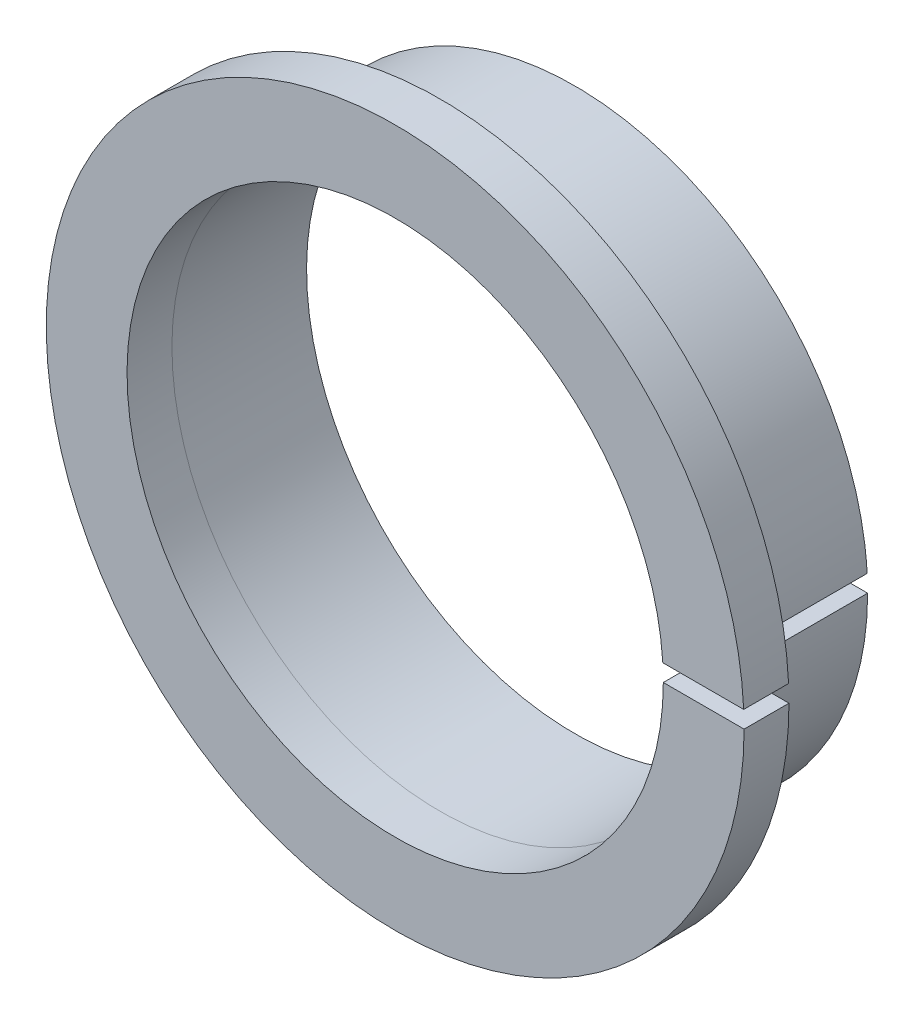
ISO-10303-21;
HEADER;
FILE_DESCRIPTION(('STEP AP214'),'2;1');
FILE_NAME('part.step','',(''),(''),'','','');
FILE_SCHEMA(('AUTOMOTIVE_DESIGN { 1 0 10303 214 1 1 1 1 }'));
ENDSEC;
DATA;
#1=APPLICATION_CONTEXT('core data for automotive mechanical design processes');
#2=APPLICATION_PROTOCOL_DEFINITION('international standard','automotive_design',2000,#1);
#3=PRODUCT_CONTEXT('',#1,'mechanical');
#4=PRODUCT('Part','Part','',(#3));
#5=PRODUCT_RELATED_PRODUCT_CATEGORY('part','',(#4));
#6=PRODUCT_DEFINITION_FORMATION('','',#4);
#7=PRODUCT_DEFINITION_CONTEXT('part definition',#1,'design');
#8=PRODUCT_DEFINITION('design','',#6,#7);
#9=PRODUCT_DEFINITION_SHAPE('','',#8);
#10=(LENGTH_UNIT() NAMED_UNIT(*) SI_UNIT(.MILLI.,.METRE.));
#11=(NAMED_UNIT(*) PLANE_ANGLE_UNIT() SI_UNIT($,.RADIAN.));
#12=(NAMED_UNIT(*) SI_UNIT($,.STERADIAN.) SOLID_ANGLE_UNIT());
#13=UNCERTAINTY_MEASURE_WITH_UNIT(LENGTH_MEASURE(1.E-05),#10,'distance_accuracy_value','');
#14=(GEOMETRIC_REPRESENTATION_CONTEXT(3) GLOBAL_UNCERTAINTY_ASSIGNED_CONTEXT((#13)) GLOBAL_UNIT_ASSIGNED_CONTEXT((#10,
#11,#12)) REPRESENTATION_CONTEXT('',''));
#15=CARTESIAN_POINT('',(0.,0.,0.));
#16=DIRECTION('',(0.,0.,1.));
#17=DIRECTION('',(1.,0.,0.));
#18=AXIS2_PLACEMENT_3D('',#15,#16,#17);
#19=CARTESIAN_POINT('',(2.00705354308598E-06,1.42271752411411E-07,-2.));
#20=DIRECTION('',(0.,0.,1.));
#21=DIRECTION('',(1.,0.,0.));
#22=AXIS2_PLACEMENT_3D('',#19,#20,#21);
#23=CYLINDRICAL_SURFACE('',#22,11.9493911238797);
#24=CARTESIAN_POINT('',(2.00705354308598E-06,1.42271752411411E-07,0.));
#25=DIRECTION('',(0.,0.,-1.));
#26=DIRECTION('',(1.,0.,0.));
#27=AXIS2_PLACEMENT_3D('',#24,#25,#26);
#28=CIRCLE('',#27,11.9493911238797);
#29=CARTESIAN_POINT('',(11.9493931309332,7.16342408847453E-12,0.));
#30=VERTEX_POINT('',#29);
#31=CARTESIAN_POINT('',(11.9258310493475,0.750033398489146,0.));
#32=VERTEX_POINT('',#31);
#33=EDGE_CURVE('E135',#30,#32,#28,.T.);
#34=ORIENTED_EDGE('',*,*,#33,.F.);
#35=DIRECTION('',(0.,0.,1.));
#36=VECTOR('',#35,1.);
#37=CARTESIAN_POINT('',(11.9493931309332,7.16342408847453E-12,-2.));
#38=LINE('',#37,#36);
#39=CARTESIAN_POINT('',(11.9493931309332,7.16342408847453E-12,-2.));
#40=VERTEX_POINT('',#39);
#41=EDGE_CURVE('E11',#40,#30,#38,.T.);
#42=ORIENTED_EDGE('',*,*,#41,.F.);
#43=CARTESIAN_POINT('',(2.00705354308598E-06,1.42271752411411E-07,-2.));
#44=DIRECTION('',(0.,0.,-1.));
#45=DIRECTION('',(1.,-1.19055932008702E-08,0.));
#46=AXIS2_PLACEMENT_3D('',#43,#44,#45);
#47=CIRCLE('',#46,11.9493911238797);
#48=CARTESIAN_POINT('',(11.9258310493475,0.750033398489146,-2.));
#49=VERTEX_POINT('',#48);
#50=EDGE_CURVE('E161',#40,#49,#47,.T.);
#51=ORIENTED_EDGE('',*,*,#50,.T.);
#52=DIRECTION('',(0.,0.,1.));
#53=VECTOR('',#52,1.);
#54=CARTESIAN_POINT('',(11.9258310493475,0.750033398489146,-2.));
#55=LINE('',#54,#53);
#56=EDGE_CURVE('E95',#49,#32,#55,.T.);
#57=ORIENTED_EDGE('',*,*,#56,.T.);
#58=EDGE_LOOP('',(#34,#42,#51,#57));
#59=FACE_BOUND('',#58,.T.);
#60=ADVANCED_FACE('F45',(#59),#23,.F.);
#61=CARTESIAN_POINT('',(15.549186155929,7.16342408844868E-12,-2.));
#62=DIRECTION('',(0.,1.,0.));
#63=DIRECTION('',(-1.,0.,0.));
#64=AXIS2_PLACEMENT_3D('',#61,#62,#63);
#65=PLANE('',#64);
#66=DIRECTION('',(-1.,0.,0.));
#67=VECTOR('',#66,1.);
#68=CARTESIAN_POINT('',(15.549186155929,7.16342408844868E-12,0.));
#69=LINE('',#68,#67);
#70=CARTESIAN_POINT('',(15.549186155929,7.16949710395623E-12,0.));
#71=VERTEX_POINT('',#70);
#72=EDGE_CURVE('E158',#71,#30,#69,.T.);
#73=ORIENTED_EDGE('',*,*,#72,.F.);
#74=DIRECTION('',(0.,0.,1.));
#75=VECTOR('',#74,1.);
#76=CARTESIAN_POINT('',(15.549186155929,7.16949710395623E-12,-2.));
#77=LINE('',#76,#75);
#78=CARTESIAN_POINT('',(15.549186155929,7.16949710395623E-12,-2.));
#79=VERTEX_POINT('',#78);
#80=EDGE_CURVE('E55',#79,#71,#77,.T.);
#81=ORIENTED_EDGE('',*,*,#80,.F.);
#82=DIRECTION('',(-1.,0.,0.));
#83=VECTOR('',#82,1.);
#84=CARTESIAN_POINT('',(15.549186155929,7.16342408844868E-12,-2.));
#85=LINE('',#84,#83);
#86=CARTESIAN_POINT('',(13.0543309151246,7.1634240884666E-12,-2.));
#87=VERTEX_POINT('',#86);
#88=EDGE_CURVE('E175',#79,#87,#85,.T.);
#89=ORIENTED_EDGE('',*,*,#88,.T.);
#90=DIRECTION('',(0.,0.,1.));
#91=VECTOR('',#90,1.);
#92=CARTESIAN_POINT('',(13.0543309151246,-1.0975886217303E-11,-8.));
#93=LINE('',#92,#91);
#94=CARTESIAN_POINT('',(13.0543309151246,-1.0975886217303E-11,-8.));
#95=VERTEX_POINT('',#94);
#96=EDGE_CURVE('E222',#95,#87,#93,.T.);
#97=ORIENTED_EDGE('',*,*,#96,.F.);
#98=DIRECTION('',(1.,0.,0.));
#99=VECTOR('',#98,1.);
#100=CARTESIAN_POINT('',(13.0543309151246,-1.0975886217303E-11,-8.));
#101=LINE('',#100,#99);
#102=CARTESIAN_POINT('',(11.9493931368572,-1.0975886217303E-11,-8.));
#103=VERTEX_POINT('',#102);
#104=EDGE_CURVE('E129',#103,#95,#101,.T.);
#105=ORIENTED_EDGE('',*,*,#104,.F.);
#106=DIRECTION('',(0.,0.,1.));
#107=VECTOR('',#106,1.);
#108=CARTESIAN_POINT('',(11.9493931368572,-1.0975886217303E-11,-8.));
#109=LINE('',#108,#107);
#110=EDGE_CURVE('E140',#103,#40,#109,.T.);
#111=ORIENTED_EDGE('',*,*,#110,.T.);
#112=ORIENTED_EDGE('',*,*,#41,.T.);
#113=EDGE_LOOP('',(#73,#81,#89,#97,#105,#111,#112));
#114=FACE_BOUND('',#113,.T.);
#115=ADVANCED_FACE('F205',(#114),#65,.T.);
#116=CARTESIAN_POINT('',(-9.8254210221895E-06,-3.26972824382649E-07,-2.));
#117=DIRECTION('',(0.,0.,1.));
#118=DIRECTION('',(1.,0.,0.));
#119=AXIS2_PLACEMENT_3D('',#116,#117,#118);
#120=CYLINDRICAL_SURFACE('',#119,15.5491959813501);
#121=CARTESIAN_POINT('',(-9.8254210221895E-06,-3.26972824382649E-07,0.));
#122=DIRECTION('',(0.,0.,1.));
#123=DIRECTION('',(1.,0.,0.));
#124=AXIS2_PLACEMENT_3D('',#121,#122,#123);
#125=CIRCLE('',#124,15.5491959813501);
#126=CARTESIAN_POINT('',(15.5310846262461,0.750066869901386,0.));
#127=VERTEX_POINT('',#126);
#128=EDGE_CURVE('E155',#127,#71,#125,.T.);
#129=ORIENTED_EDGE('',*,*,#128,.F.);
#130=DIRECTION('',(0.,0.,1.));
#131=VECTOR('',#130,1.);
#132=CARTESIAN_POINT('',(15.5310846262461,0.750066869901386,-2.));
#133=LINE('',#132,#131);
#134=CARTESIAN_POINT('',(15.5310846262461,0.750066869901386,-2.));
#135=VERTEX_POINT('',#134);
#136=EDGE_CURVE('E163',#135,#127,#133,.T.);
#137=ORIENTED_EDGE('',*,*,#136,.F.);
#138=CARTESIAN_POINT('',(-9.8254210221895E-06,-3.26972824382649E-07,-2.));
#139=DIRECTION('',(0.,0.,1.));
#140=DIRECTION('',(1.,0.,0.));
#141=AXIS2_PLACEMENT_3D('',#138,#139,#140);
#142=CIRCLE('',#141,15.5491959813501);
#143=EDGE_CURVE('E177',#135,#79,#142,.T.);
#144=ORIENTED_EDGE('',*,*,#143,.T.);
#145=ORIENTED_EDGE('',*,*,#80,.T.);
#146=EDGE_LOOP('',(#129,#137,#144,#145));
#147=FACE_BOUND('',#146,.T.);
#148=ADVANCED_FACE('F202',(#147),#120,.T.);
#149=CARTESIAN_POINT('',(11.9258310493475,0.750033398489146,-2.));
#150=DIRECTION('',(9.28406602328647E-06,-0.999999999956903,0.));
#151=DIRECTION('',(0.999999999956903,9.28406602328647E-06,0.));
#152=AXIS2_PLACEMENT_3D('',#149,#150,#151);
#153=PLANE('',#152);
#154=DIRECTION('',(0.999999999956903,9.28406602328647E-06,0.));
#155=VECTOR('',#154,1.);
#156=CARTESIAN_POINT('',(11.9258310493475,0.750033398489146,0.));
#157=LINE('',#156,#155);
#158=EDGE_CURVE('E138',#32,#127,#157,.T.);
#159=ORIENTED_EDGE('',*,*,#158,.F.);
#160=ORIENTED_EDGE('',*,*,#56,.F.);
#161=CARTESIAN_POINT('',(11.9258310493475,0.750033398489146,-2.));
#162=DIRECTION('',(0.999999999956903,9.2840660232462E-06,0.));
#163=VECTOR('',#162,1.);
#164=LINE('',#161,#163);
#165=CARTESIAN_POINT('',(13.0327653459519,0.750055352562733,-2.));
#166=VERTEX_POINT('',#165);
#167=EDGE_CURVE('E184',#49,#166,#164,.T.);
#168=ORIENTED_EDGE('',*,*,#167,.T.);
#169=CARTESIAN_POINT('',(13.0327660179932,0.750043675346479,-2.));
#170=DIRECTION('',(0.999999999956903,9.28406602330431E-06,0.));
#171=VECTOR('',#170,1.);
#172=LINE('',#169,#171);
#173=EDGE_CURVE('E250',#166,#135,#172,.T.);
#174=ORIENTED_EDGE('',*,*,#173,.T.);
#175=ORIENTED_EDGE('',*,*,#136,.T.);
#176=EDGE_LOOP('',(#159,#160,#168,#174,#175));
#177=FACE_BOUND('',#176,.T.);
#178=ADVANCED_FACE('F192',(#177),#153,.T.);
#179=CARTESIAN_POINT('',(2.00705354308598E-06,1.42271752411411E-07,-2.));
#180=DIRECTION('',(0.,0.,1.));
#181=DIRECTION('',(1.,0.,0.));
#182=AXIS2_PLACEMENT_3D('',#179,#180,#181);
#183=PLANE('',#182);
#184=CARTESIAN_POINT('',(-6.04501046479502E-06,-2.05061976929599E-07,-2.));
#185=DIRECTION('',(0.,0.,-1.));
#186=DIRECTION('',(0.,1.,0.));
#187=AXIS2_PLACEMENT_3D('',#184,#185,#186);
#188=ELLIPSE('',#187,13.0543369601399,13.054336960135);
#189=EDGE_CURVE('E62',#87,#166,#188,.T.);
#190=ORIENTED_EDGE('',*,*,#189,.F.);
#191=ORIENTED_EDGE('',*,*,#88,.F.);
#192=ORIENTED_EDGE('',*,*,#143,.F.);
#193=ORIENTED_EDGE('',*,*,#173,.F.);
#194=EDGE_LOOP('',(#190,#191,#192,#193));
#195=FACE_BOUND('',#194,.T.);
#196=ADVANCED_FACE('F201',(#195),#183,.F.);
#197=CARTESIAN_POINT('',(2.00705354308598E-06,1.42271752411411E-07,0.));
#198=DIRECTION('',(0.,0.,1.));
#199=DIRECTION('',(1.,0.,0.));
#200=AXIS2_PLACEMENT_3D('',#197,#198,#199);
#201=PLANE('',#200);
#202=ORIENTED_EDGE('',*,*,#33,.T.);
#203=ORIENTED_EDGE('',*,*,#158,.T.);
#204=ORIENTED_EDGE('',*,*,#128,.T.);
#205=ORIENTED_EDGE('',*,*,#72,.T.);
#206=EDGE_LOOP('',(#202,#203,#204,#205));
#207=FACE_BOUND('',#206,.T.);
#208=ADVANCED_FACE('F209',(#207),#201,.T.);
#209=CARTESIAN_POINT('',(-6.04501046479502E-06,-2.05061976929599E-07,-8.));
#210=DIRECTION('',(0.,0.,-1.));
#211=DIRECTION('',(0.,1.,0.));
#212=AXIS2_PLACEMENT_3D('',#209,#210,#211);
#213=ELLIPSE('',#212,13.0543369601399,13.054336960135);
#214=DIRECTION('',(0.,0.,1.));
#215=VECTOR('',#214,1.);
#216=SURFACE_OF_LINEAR_EXTRUSION('',#213,#215);
#217=ORIENTED_EDGE('',*,*,#189,.T.);
#218=DIRECTION('',(0.,0.,1.));
#219=VECTOR('',#218,1.);
#220=CARTESIAN_POINT('',(13.0327646739106,0.750067029778987,-8.));
#221=LINE('',#220,#219);
#222=CARTESIAN_POINT('',(13.0327646739106,0.750067029778987,-8.));
#223=VERTEX_POINT('',#222);
#224=EDGE_CURVE('E118',#223,#166,#221,.T.);
#225=ORIENTED_EDGE('',*,*,#224,.F.);
#226=EDGE_CURVE('E124',#95,#223,#213,.T.);
#227=ORIENTED_EDGE('',*,*,#226,.F.);
#228=ORIENTED_EDGE('',*,*,#96,.T.);
#229=EDGE_LOOP('',(#217,#225,#227,#228));
#230=FACE_BOUND('',#229,.T.);
#231=ADVANCED_FACE('F134',(#230),#216,.F.);
#232=CARTESIAN_POINT('',(13.0327646739106,0.750067029778987,-8.));
#233=DIRECTION('',(-3.03823906683306E-05,0.999999999538455,0.));
#234=DIRECTION('',(-0.999999999538455,-3.03823906683306E-05,0.));
#235=AXIS2_PLACEMENT_3D('',#232,#233,#234);
#236=PLANE('',#235);
#237=ORIENTED_EDGE('',*,*,#167,.F.);
#238=DIRECTION('',(0.,0.,1.));
#239=VECTOR('',#238,1.);
#240=CARTESIAN_POINT('',(11.9258310493475,0.750033398489157,-8.));
#241=LINE('',#240,#239);
#242=CARTESIAN_POINT('',(11.9258310493475,0.750033398489157,-8.));
#243=VERTEX_POINT('',#242);
#244=EDGE_CURVE('E120',#243,#49,#241,.T.);
#245=ORIENTED_EDGE('',*,*,#244,.F.);
#246=DIRECTION('',(-0.999999999538455,-3.03823906683306E-05,0.));
#247=VECTOR('',#246,1.);
#248=CARTESIAN_POINT('',(13.0327646739106,0.750067029778987,-8.));
#249=LINE('',#248,#247);
#250=EDGE_CURVE('E113',#223,#243,#249,.T.);
#251=ORIENTED_EDGE('',*,*,#250,.F.);
#252=ORIENTED_EDGE('',*,*,#224,.T.);
#253=EDGE_LOOP('',(#237,#245,#251,#252));
#254=FACE_BOUND('',#253,.T.);
#255=ADVANCED_FACE('F116',(#254),#236,.F.);
#256=CARTESIAN_POINT('',(-6.04501046479502E-06,-2.05061976929599E-07,-8.));
#257=DIRECTION('',(0.,0.,1.));
#258=DIRECTION('',(1.,0.,0.));
#259=AXIS2_PLACEMENT_3D('',#256,#257,#258);
#260=CYLINDRICAL_SURFACE('',#259,11.9493991818677);
#261=ORIENTED_EDGE('',*,*,#50,.F.);
#262=ORIENTED_EDGE('',*,*,#110,.F.);
#263=CARTESIAN_POINT('',(-6.04501046479502E-06,-2.05061976929599E-07,-8.));
#264=DIRECTION('',(0.,0.,1.));
#265=DIRECTION('',(-1.,0.,0.));
#266=AXIS2_PLACEMENT_3D('',#263,#264,#265);
#267=CIRCLE('',#266,11.9493991818677);
#268=EDGE_CURVE('E123',#243,#103,#267,.T.);
#269=ORIENTED_EDGE('',*,*,#268,.F.);
#270=ORIENTED_EDGE('',*,*,#244,.T.);
#271=EDGE_LOOP('',(#261,#262,#269,#270));
#272=FACE_BOUND('',#271,.T.);
#273=ADVANCED_FACE('F230',(#272),#260,.F.);
#274=CARTESIAN_POINT('',(-6.04501046479502E-06,-2.05061976929599E-07,-8.));
#275=DIRECTION('',(0.,0.,-1.));
#276=DIRECTION('',(-1.,0.,0.));
#277=AXIS2_PLACEMENT_3D('',#274,#275,#276);
#278=PLANE('',#277);
#279=ORIENTED_EDGE('',*,*,#226,.T.);
#280=ORIENTED_EDGE('',*,*,#250,.T.);
#281=ORIENTED_EDGE('',*,*,#268,.T.);
#282=ORIENTED_EDGE('',*,*,#104,.T.);
#283=EDGE_LOOP('',(#279,#280,#281,#282));
#284=FACE_BOUND('',#283,.T.);
#285=ADVANCED_FACE('F127',(#284),#278,.T.);
#286=CLOSED_SHELL('',(#60,#115,#148,#178,#196,#208,#231,#255,#273,#285));
#287=MANIFOLD_SOLID_BREP('B2',#286);
#288=ADVANCED_BREP_SHAPE_REPRESENTATION('',(#18,#287),#14);
#289=SHAPE_DEFINITION_REPRESENTATION(#9,#288);
ENDSEC;
END-ISO-10303-21;
